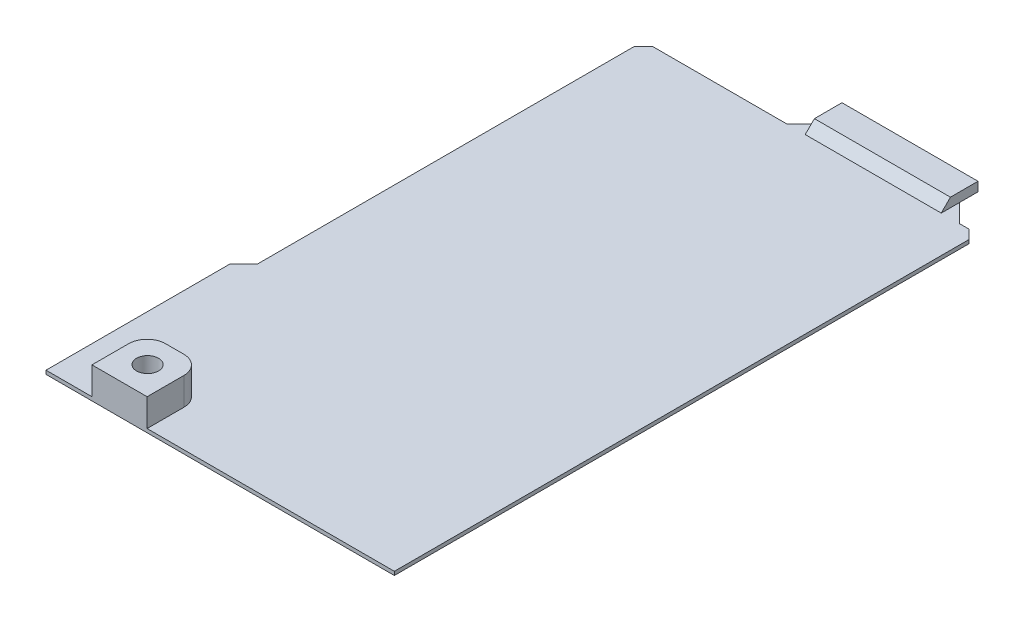
ISO-10303-21;
HEADER;
FILE_DESCRIPTION(('STEP AP214'),'2;1');
FILE_NAME('part.step','',(''),(''),'','','');
FILE_SCHEMA(('AUTOMOTIVE_DESIGN { 1 0 10303 214 1 1 1 1 }'));
ENDSEC;
DATA;
#1=APPLICATION_CONTEXT('core data for automotive mechanical design processes');
#2=APPLICATION_PROTOCOL_DEFINITION('international standard','automotive_design',2000,#1);
#3=PRODUCT_CONTEXT('',#1,'mechanical');
#4=PRODUCT('Part','Part','',(#3));
#5=PRODUCT_RELATED_PRODUCT_CATEGORY('part','',(#4));
#6=PRODUCT_DEFINITION_FORMATION('','',#4);
#7=PRODUCT_DEFINITION_CONTEXT('part definition',#1,'design');
#8=PRODUCT_DEFINITION('design','',#6,#7);
#9=PRODUCT_DEFINITION_SHAPE('','',#8);
#10=(LENGTH_UNIT() NAMED_UNIT(*) SI_UNIT(.MILLI.,.METRE.));
#11=(NAMED_UNIT(*) PLANE_ANGLE_UNIT() SI_UNIT($,.RADIAN.));
#12=(NAMED_UNIT(*) SI_UNIT($,.STERADIAN.) SOLID_ANGLE_UNIT());
#13=UNCERTAINTY_MEASURE_WITH_UNIT(LENGTH_MEASURE(1.E-05),#10,'distance_accuracy_value','');
#14=(GEOMETRIC_REPRESENTATION_CONTEXT(3) GLOBAL_UNCERTAINTY_ASSIGNED_CONTEXT((#13)) GLOBAL_UNIT_ASSIGNED_CONTEXT((#10,
#11,#12)) REPRESENTATION_CONTEXT('',''));
#15=CARTESIAN_POINT('',(0.,0.,0.));
#16=DIRECTION('',(0.,0.,1.));
#17=DIRECTION('',(1.,0.,0.));
#18=AXIS2_PLACEMENT_3D('',#15,#16,#17);
#19=CARTESIAN_POINT('',(8.,4.,-3.05));
#20=DIRECTION('',(0.,-1.,0.));
#21=DIRECTION('',(0.,0.,-1.));
#22=AXIS2_PLACEMENT_3D('',#19,#20,#21);
#23=CYLINDRICAL_SURFACE('',#22,1.2);
#24=CARTESIAN_POINT('',(8.,4.,-3.05));
#25=DIRECTION('',(0.,-1.,0.));
#26=DIRECTION('',(0.,0.,-1.));
#27=AXIS2_PLACEMENT_3D('',#24,#25,#26);
#28=CIRCLE('',#27,1.2);
#29=CARTESIAN_POINT('',(8.,4.,-4.25));
#30=VERTEX_POINT('',#29);
#31=EDGE_CURVE('E427',#30,#30,#28,.T.);
#32=ORIENTED_EDGE('',*,*,#31,.F.);
#33=EDGE_LOOP('',(#32));
#34=FACE_BOUND('',#33,.T.);
#35=CARTESIAN_POINT('',(8.,2.,-3.05));
#36=DIRECTION('',(0.,-1.,0.));
#37=DIRECTION('',(0.,0.,-1.));
#38=AXIS2_PLACEMENT_3D('',#35,#36,#37);
#39=CIRCLE('',#38,1.2);
#40=CARTESIAN_POINT('',(8.,2.,-4.25));
#41=VERTEX_POINT('',#40);
#42=EDGE_CURVE('E424',#41,#41,#39,.F.);
#43=ORIENTED_EDGE('',*,*,#42,.F.);
#44=EDGE_LOOP('',(#43));
#45=FACE_BOUND('',#44,.T.);
#46=ADVANCED_FACE('F37',(#34,#45),#23,.F.);
#47=CARTESIAN_POINT('',(0.,1.,0.));
#48=DIRECTION('',(0.,-1.,0.));
#49=DIRECTION('',(0.,0.,-1.));
#50=AXIS2_PLACEMENT_3D('',#47,#48,#49);
#51=PLANE('',#50);
#52=DIRECTION('',(0.,0.,-1.));
#53=VECTOR('',#52,1.);
#54=CARTESIAN_POINT('',(11.,1.,0.));
#55=LINE('',#54,#53);
#56=CARTESIAN_POINT('',(11.,1.,0.));
#57=VERTEX_POINT('',#56);
#58=CARTESIAN_POINT('',(11.,1.,-4.));
#59=VERTEX_POINT('',#58);
#60=EDGE_CURVE('E949',#57,#59,#55,.T.);
#61=ORIENTED_EDGE('',*,*,#60,.F.);
#62=DIRECTION('',(1.,0.,0.));
#63=VECTOR('',#62,1.);
#64=CARTESIAN_POINT('',(0.,1.,0.));
#65=LINE('',#64,#63);
#66=CARTESIAN_POINT('',(37.9,1.,0.));
#67=VERTEX_POINT('',#66);
#68=EDGE_CURVE('E248',#57,#67,#65,.T.);
#69=ORIENTED_EDGE('',*,*,#68,.T.);
#70=DIRECTION('',(0.,0.,-1.));
#71=VECTOR('',#70,1.);
#72=CARTESIAN_POINT('',(37.9,1.,0.));
#73=LINE('',#72,#71);
#74=CARTESIAN_POINT('',(37.9,1.,-62.5));
#75=VERTEX_POINT('',#74);
#76=EDGE_CURVE('E286',#67,#75,#73,.T.);
#77=ORIENTED_EDGE('',*,*,#76,.T.);
#78=DIRECTION('',(-0.707106781186547,0.,-0.707106781186547));
#79=VECTOR('',#78,1.);
#80=CARTESIAN_POINT('',(36.9,1.,-63.5));
#81=LINE('',#80,#79);
#82=CARTESIAN_POINT('',(36.9,1.,-63.5));
#83=VERTEX_POINT('',#82);
#84=EDGE_CURVE('E288',#75,#83,#81,.T.);
#85=ORIENTED_EDGE('',*,*,#84,.T.);
#86=DIRECTION('',(-1.,0.,0.));
#87=VECTOR('',#86,1.);
#88=CARTESIAN_POINT('',(35.9,1.,-63.5));
#89=LINE('',#88,#87);
#90=CARTESIAN_POINT('',(35.9,1.,-63.5));
#91=VERTEX_POINT('',#90);
#92=EDGE_CURVE('E290',#83,#91,#89,.T.);
#93=ORIENTED_EDGE('',*,*,#92,.T.);
#94=DIRECTION('',(-0.707106781186547,0.,-0.707106781186547));
#95=VECTOR('',#94,1.);
#96=CARTESIAN_POINT('',(35.9,1.,-63.5));
#97=LINE('',#96,#95);
#98=CARTESIAN_POINT('',(33.9,1.,-65.5));
#99=VERTEX_POINT('',#98);
#100=EDGE_CURVE('E292',#91,#99,#97,.T.);
#101=ORIENTED_EDGE('',*,*,#100,.T.);
#102=DIRECTION('',(0.,0.,-1.));
#103=VECTOR('',#102,1.);
#104=CARTESIAN_POINT('',(33.9,1.,-67.5));
#105=LINE('',#104,#103);
#106=CARTESIAN_POINT('',(33.9,1.,-63.5));
#107=VERTEX_POINT('',#106);
#108=EDGE_CURVE('E270',#107,#99,#105,.T.);
#109=ORIENTED_EDGE('',*,*,#108,.F.);
#110=DIRECTION('',(1.,0.,0.));
#111=VECTOR('',#110,1.);
#112=CARTESIAN_POINT('',(19.1,1.,-63.5));
#113=LINE('',#112,#111);
#114=CARTESIAN_POINT('',(19.1,1.,-63.5));
#115=VERTEX_POINT('',#114);
#116=EDGE_CURVE('E253',#115,#107,#113,.T.);
#117=ORIENTED_EDGE('',*,*,#116,.F.);
#118=DIRECTION('',(0.,0.,1.));
#119=VECTOR('',#118,1.);
#120=CARTESIAN_POINT('',(19.1,1.,-67.5));
#121=LINE('',#120,#119);
#122=CARTESIAN_POINT('',(19.1,1.,-65.5));
#123=VERTEX_POINT('',#122);
#124=EDGE_CURVE('E255',#123,#115,#121,.T.);
#125=ORIENTED_EDGE('',*,*,#124,.F.);
#126=DIRECTION('',(-0.707106781186547,0.,0.707106781186548));
#127=VECTOR('',#126,1.);
#128=CARTESIAN_POINT('',(17.1,1.,-63.5));
#129=LINE('',#128,#127);
#130=CARTESIAN_POINT('',(17.1,1.,-63.5));
#131=VERTEX_POINT('',#130);
#132=EDGE_CURVE('E297',#123,#131,#129,.T.);
#133=ORIENTED_EDGE('',*,*,#132,.T.);
#134=DIRECTION('',(-1.,0.,0.));
#135=VECTOR('',#134,1.);
#136=CARTESIAN_POINT('',(2.50000000000001,1.,-63.5));
#137=LINE('',#136,#135);
#138=CARTESIAN_POINT('',(2.50000000000001,1.,-63.5));
#139=VERTEX_POINT('',#138);
#140=EDGE_CURVE('E299',#131,#139,#137,.T.);
#141=ORIENTED_EDGE('',*,*,#140,.T.);
#142=DIRECTION('',(-0.707106781186547,0.,0.707106781186548));
#143=VECTOR('',#142,1.);
#144=CARTESIAN_POINT('',(1.50000000000001,1.,-62.5));
#145=LINE('',#144,#143);
#146=CARTESIAN_POINT('',(1.50000000000001,1.,-62.5));
#147=VERTEX_POINT('',#146);
#148=EDGE_CURVE('E301',#139,#147,#145,.T.);
#149=ORIENTED_EDGE('',*,*,#148,.T.);
#150=DIRECTION('',(0.,0.,1.));
#151=VECTOR('',#150,1.);
#152=CARTESIAN_POINT('',(1.50000000000001,1.,-62.5));
#153=LINE('',#152,#151);
#154=CARTESIAN_POINT('',(1.50000000000002,1.,-21.5));
#155=VERTEX_POINT('',#154);
#156=EDGE_CURVE('E303',#147,#155,#153,.T.);
#157=ORIENTED_EDGE('',*,*,#156,.T.);
#158=DIRECTION('',(-0.707106781186549,0.,0.707106781186546));
#159=VECTOR('',#158,1.);
#160=CARTESIAN_POINT('',(1.50000000000002,1.,-21.5));
#161=LINE('',#160,#159);
#162=CARTESIAN_POINT('',(0.,1.,-20.));
#163=VERTEX_POINT('',#162);
#164=EDGE_CURVE('E305',#155,#163,#161,.T.);
#165=ORIENTED_EDGE('',*,*,#164,.T.);
#166=DIRECTION('',(0.,0.,1.));
#167=VECTOR('',#166,1.);
#168=CARTESIAN_POINT('',(0.,1.,0.));
#169=LINE('',#168,#167);
#170=CARTESIAN_POINT('',(0.,1.,0.));
#171=VERTEX_POINT('',#170);
#172=EDGE_CURVE('E280',#163,#171,#169,.T.);
#173=ORIENTED_EDGE('',*,*,#172,.T.);
#174=CARTESIAN_POINT('',(5.,1.,0.));
#175=VERTEX_POINT('',#174);
#176=EDGE_CURVE('E284',#171,#175,#65,.T.);
#177=ORIENTED_EDGE('',*,*,#176,.T.);
#178=DIRECTION('',(0.,0.,1.));
#179=VECTOR('',#178,1.);
#180=CARTESIAN_POINT('',(5.,1.,-4.));
#181=LINE('',#180,#179);
#182=CARTESIAN_POINT('',(5.,1.,-4.));
#183=VERTEX_POINT('',#182);
#184=EDGE_CURVE('E243',#183,#175,#181,.T.);
#185=ORIENTED_EDGE('',*,*,#184,.F.);
#186=CARTESIAN_POINT('',(7.,1.,-4.));
#187=DIRECTION('',(0.,1.,0.));
#188=DIRECTION('',(0.,0.,1.));
#189=AXIS2_PLACEMENT_3D('',#186,#187,#188);
#190=CIRCLE('',#189,2.);
#191=CARTESIAN_POINT('',(7.,1.,-6.));
#192=VERTEX_POINT('',#191);
#193=EDGE_CURVE('E965',#192,#183,#190,.T.);
#194=ORIENTED_EDGE('',*,*,#193,.F.);
#195=DIRECTION('',(-1.,0.,0.));
#196=VECTOR('',#195,1.);
#197=CARTESIAN_POINT('',(9.,1.,-6.));
#198=LINE('',#197,#196);
#199=CARTESIAN_POINT('',(9.,1.,-6.));
#200=VERTEX_POINT('',#199);
#201=EDGE_CURVE('E962',#200,#192,#198,.T.);
#202=ORIENTED_EDGE('',*,*,#201,.F.);
#203=CARTESIAN_POINT('',(9.,1.,-4.));
#204=DIRECTION('',(0.,1.,0.));
#205=DIRECTION('',(0.,0.,1.));
#206=AXIS2_PLACEMENT_3D('',#203,#204,#205);
#207=CIRCLE('',#206,2.);
#208=EDGE_CURVE('E959',#59,#200,#207,.T.);
#209=ORIENTED_EDGE('',*,*,#208,.F.);
#210=EDGE_LOOP('',(#61,#69,#77,#85,#93,#101,#109,#117,#125,#133,#141,#149,#157,#165,#173,#177,
#185,#194,#202,#209));
#211=FACE_BOUND('',#210,.T.);
#212=ADVANCED_FACE('F436',(#211),#51,.F.);
#213=CARTESIAN_POINT('',(0.,1.,0.));
#214=DIRECTION('',(1.,0.,0.));
#215=DIRECTION('',(0.,0.,-1.));
#216=AXIS2_PLACEMENT_3D('',#213,#214,#215);
#217=PLANE('',#216);
#218=DIRECTION('',(0.,-1.,0.));
#219=VECTOR('',#218,1.);
#220=CARTESIAN_POINT('',(0.,1.,-20.));
#221=LINE('',#220,#219);
#222=CARTESIAN_POINT('',(0.,0.600000000000003,-20.));
#223=VERTEX_POINT('',#222);
#224=EDGE_CURVE('E307',#163,#223,#221,.T.);
#225=ORIENTED_EDGE('',*,*,#224,.T.);
#226=DIRECTION('',(0.,0.,1.));
#227=VECTOR('',#226,1.);
#228=CARTESIAN_POINT('',(0.,0.600000000000003,0.));
#229=LINE('',#228,#227);
#230=CARTESIAN_POINT('',(0.,0.600000000000003,0.));
#231=VERTEX_POINT('',#230);
#232=EDGE_CURVE('E390',#223,#231,#229,.T.);
#233=ORIENTED_EDGE('',*,*,#232,.T.);
#234=DIRECTION('',(0.,-1.,0.));
#235=VECTOR('',#234,1.);
#236=CARTESIAN_POINT('',(0.,1.,0.));
#237=LINE('',#236,#235);
#238=EDGE_CURVE('E340',#171,#231,#237,.T.);
#239=ORIENTED_EDGE('',*,*,#238,.F.);
#240=ORIENTED_EDGE('',*,*,#172,.F.);
#241=EDGE_LOOP('',(#225,#233,#239,#240));
#242=FACE_BOUND('',#241,.T.);
#243=ADVANCED_FACE('F485',(#242),#217,.F.);
#244=CARTESIAN_POINT('',(0.,1.,0.));
#245=DIRECTION('',(0.,0.,-1.));
#246=DIRECTION('',(-1.,0.,0.));
#247=AXIS2_PLACEMENT_3D('',#244,#245,#246);
#248=PLANE('',#247);
#249=ORIENTED_EDGE('',*,*,#238,.T.);
#250=DIRECTION('',(1.,0.,0.));
#251=VECTOR('',#250,1.);
#252=CARTESIAN_POINT('',(37.9,0.600000000000003,0.));
#253=LINE('',#252,#251);
#254=CARTESIAN_POINT('',(37.9,0.600000000000003,0.));
#255=VERTEX_POINT('',#254);
#256=EDGE_CURVE('E342',#231,#255,#253,.T.);
#257=ORIENTED_EDGE('',*,*,#256,.T.);
#258=DIRECTION('',(0.,-1.,0.));
#259=VECTOR('',#258,1.);
#260=CARTESIAN_POINT('',(37.9,1.,0.));
#261=LINE('',#260,#259);
#262=EDGE_CURVE('E337',#67,#255,#261,.T.);
#263=ORIENTED_EDGE('',*,*,#262,.F.);
#264=ORIENTED_EDGE('',*,*,#68,.F.);
#265=DIRECTION('',(0.,-1.,0.));
#266=VECTOR('',#265,1.);
#267=CARTESIAN_POINT('',(11.,4.,0.));
#268=LINE('',#267,#266);
#269=CARTESIAN_POINT('',(11.,4.,0.));
#270=VERTEX_POINT('',#269);
#271=EDGE_CURVE('E228',#270,#57,#268,.T.);
#272=ORIENTED_EDGE('',*,*,#271,.F.);
#273=DIRECTION('',(1.,0.,0.));
#274=VECTOR('',#273,1.);
#275=CARTESIAN_POINT('',(5.,4.,0.));
#276=LINE('',#275,#274);
#277=CARTESIAN_POINT('',(5.,4.,0.));
#278=VERTEX_POINT('',#277);
#279=EDGE_CURVE('E234',#278,#270,#276,.T.);
#280=ORIENTED_EDGE('',*,*,#279,.F.);
#281=DIRECTION('',(0.,-1.,0.));
#282=VECTOR('',#281,1.);
#283=CARTESIAN_POINT('',(5.,4.,0.));
#284=LINE('',#283,#282);
#285=EDGE_CURVE('E957',#278,#175,#284,.T.);
#286=ORIENTED_EDGE('',*,*,#285,.T.);
#287=ORIENTED_EDGE('',*,*,#176,.F.);
#288=EDGE_LOOP('',(#249,#257,#263,#264,#272,#280,#286,#287));
#289=FACE_BOUND('',#288,.T.);
#290=ADVANCED_FACE('F246',(#289),#248,.F.);
#291=CARTESIAN_POINT('',(37.9,1.,0.));
#292=DIRECTION('',(-1.,0.,0.));
#293=DIRECTION('',(0.,0.,1.));
#294=AXIS2_PLACEMENT_3D('',#291,#292,#293);
#295=PLANE('',#294);
#296=ORIENTED_EDGE('',*,*,#262,.T.);
#297=DIRECTION('',(0.,0.,-1.));
#298=VECTOR('',#297,1.);
#299=CARTESIAN_POINT('',(37.9,0.600000000000003,-62.5));
#300=LINE('',#299,#298);
#301=CARTESIAN_POINT('',(37.9,0.600000000000003,-62.5));
#302=VERTEX_POINT('',#301);
#303=EDGE_CURVE('E370',#255,#302,#300,.T.);
#304=ORIENTED_EDGE('',*,*,#303,.T.);
#305=DIRECTION('',(0.,-1.,0.));
#306=VECTOR('',#305,1.);
#307=CARTESIAN_POINT('',(37.9,1.,-62.5));
#308=LINE('',#307,#306);
#309=EDGE_CURVE('E334',#75,#302,#308,.T.);
#310=ORIENTED_EDGE('',*,*,#309,.F.);
#311=ORIENTED_EDGE('',*,*,#76,.F.);
#312=EDGE_LOOP('',(#296,#304,#310,#311));
#313=FACE_BOUND('',#312,.T.);
#314=ADVANCED_FACE('F503',(#313),#295,.F.);
#315=CARTESIAN_POINT('',(36.9,1.,-63.5));
#316=DIRECTION('',(-0.707106781186547,0.,0.707106781186547));
#317=DIRECTION('',(0.707106781186548,0.,0.707106781186548));
#318=AXIS2_PLACEMENT_3D('',#315,#316,#317);
#319=PLANE('',#318);
#320=ORIENTED_EDGE('',*,*,#309,.T.);
#321=DIRECTION('',(-0.707106781186548,0.,-0.707106781186548));
#322=VECTOR('',#321,1.);
#323=CARTESIAN_POINT('',(36.9,0.600000000000003,-63.5));
#324=LINE('',#323,#322);
#325=CARTESIAN_POINT('',(36.9,0.600000000000003,-63.5));
#326=VERTEX_POINT('',#325);
#327=EDGE_CURVE('E372',#302,#326,#324,.T.);
#328=ORIENTED_EDGE('',*,*,#327,.T.);
#329=DIRECTION('',(0.,-1.,0.));
#330=VECTOR('',#329,1.);
#331=CARTESIAN_POINT('',(36.9,1.,-63.5));
#332=LINE('',#331,#330);
#333=EDGE_CURVE('E331',#83,#326,#332,.T.);
#334=ORIENTED_EDGE('',*,*,#333,.F.);
#335=ORIENTED_EDGE('',*,*,#84,.F.);
#336=EDGE_LOOP('',(#320,#328,#334,#335));
#337=FACE_BOUND('',#336,.T.);
#338=ADVANCED_FACE('F508',(#337),#319,.F.);
#339=CARTESIAN_POINT('',(35.9,1.,-63.5));
#340=DIRECTION('',(0.,0.,1.));
#341=DIRECTION('',(1.,0.,0.));
#342=AXIS2_PLACEMENT_3D('',#339,#340,#341);
#343=PLANE('',#342);
#344=ORIENTED_EDGE('',*,*,#333,.T.);
#345=DIRECTION('',(-1.,0.,0.));
#346=VECTOR('',#345,1.);
#347=CARTESIAN_POINT('',(35.9,0.600000000000003,-63.5));
#348=LINE('',#347,#346);
#349=CARTESIAN_POINT('',(35.9,0.600000000000003,-63.5));
#350=VERTEX_POINT('',#349);
#351=EDGE_CURVE('E374',#326,#350,#348,.T.);
#352=ORIENTED_EDGE('',*,*,#351,.T.);
#353=DIRECTION('',(0.,-1.,0.));
#354=VECTOR('',#353,1.);
#355=CARTESIAN_POINT('',(35.9,1.,-63.5));
#356=LINE('',#355,#354);
#357=EDGE_CURVE('E328',#91,#350,#356,.T.);
#358=ORIENTED_EDGE('',*,*,#357,.F.);
#359=ORIENTED_EDGE('',*,*,#92,.F.);
#360=EDGE_LOOP('',(#344,#352,#358,#359));
#361=FACE_BOUND('',#360,.T.);
#362=ADVANCED_FACE('F521',(#361),#343,.F.);
#363=CARTESIAN_POINT('',(35.9,1.,-63.5));
#364=DIRECTION('',(-0.707106781186547,0.,0.707106781186547));
#365=DIRECTION('',(0.707106781186548,0.,0.707106781186548));
#366=AXIS2_PLACEMENT_3D('',#363,#364,#365);
#367=PLANE('',#366);
#368=ORIENTED_EDGE('',*,*,#357,.T.);
#369=DIRECTION('',(-0.707106781186548,0.,-0.707106781186548));
#370=VECTOR('',#369,1.);
#371=CARTESIAN_POINT('',(33.9,0.600000000000003,-65.5));
#372=LINE('',#371,#370);
#373=CARTESIAN_POINT('',(33.9,0.600000000000003,-65.5));
#374=VERTEX_POINT('',#373);
#375=EDGE_CURVE('E376',#350,#374,#372,.T.);
#376=ORIENTED_EDGE('',*,*,#375,.T.);
#377=DIRECTION('',(0.,-1.,0.));
#378=VECTOR('',#377,1.);
#379=CARTESIAN_POINT('',(33.9,1.,-65.5));
#380=LINE('',#379,#378);
#381=EDGE_CURVE('E325',#99,#374,#380,.T.);
#382=ORIENTED_EDGE('',*,*,#381,.F.);
#383=ORIENTED_EDGE('',*,*,#100,.F.);
#384=EDGE_LOOP('',(#368,#376,#382,#383));
#385=FACE_BOUND('',#384,.T.);
#386=ADVANCED_FACE('F525',(#385),#367,.F.);
#387=CARTESIAN_POINT('',(33.9,1.,-65.5));
#388=DIRECTION('',(0.,0.,1.));
#389=DIRECTION('',(1.,0.,0.));
#390=AXIS2_PLACEMENT_3D('',#387,#388,#389);
#391=PLANE('',#390);
#392=ORIENTED_EDGE('',*,*,#381,.T.);
#393=DIRECTION('',(-1.,0.,0.));
#394=VECTOR('',#393,1.);
#395=CARTESIAN_POINT('',(19.1,0.600000000000003,-65.5));
#396=LINE('',#395,#394);
#397=CARTESIAN_POINT('',(19.1,0.600000000000003,-65.5));
#398=VERTEX_POINT('',#397);
#399=EDGE_CURVE('E378',#374,#398,#396,.T.);
#400=ORIENTED_EDGE('',*,*,#399,.T.);
#401=DIRECTION('',(0.,-1.,0.));
#402=VECTOR('',#401,1.);
#403=CARTESIAN_POINT('',(19.1,1.,-65.5));
#404=LINE('',#403,#402);
#405=EDGE_CURVE('E322',#123,#398,#404,.T.);
#406=ORIENTED_EDGE('',*,*,#405,.F.);
#407=DIRECTION('',(-1.,0.,0.));
#408=VECTOR('',#407,1.);
#409=CARTESIAN_POINT('',(33.9,1.,-65.5));
#410=LINE('',#409,#408);
#411=EDGE_CURVE('E294',#99,#123,#410,.T.);
#412=ORIENTED_EDGE('',*,*,#411,.F.);
#413=EDGE_LOOP('',(#392,#400,#406,#412));
#414=FACE_BOUND('',#413,.T.);
#415=ADVANCED_FACE('F453',(#414),#391,.F.);
#416=CARTESIAN_POINT('',(17.1,1.,-63.5));
#417=DIRECTION('',(0.707106781186548,0.,0.707106781186547));
#418=DIRECTION('',(0.707106781186547,0.,-0.707106781186548));
#419=AXIS2_PLACEMENT_3D('',#416,#417,#418);
#420=PLANE('',#419);
#421=ORIENTED_EDGE('',*,*,#405,.T.);
#422=DIRECTION('',(-0.707106781186547,0.,0.707106781186548));
#423=VECTOR('',#422,1.);
#424=CARTESIAN_POINT('',(17.1,0.600000000000003,-63.5));
#425=LINE('',#424,#423);
#426=CARTESIAN_POINT('',(17.1,0.600000000000003,-63.5));
#427=VERTEX_POINT('',#426);
#428=EDGE_CURVE('E380',#398,#427,#425,.T.);
#429=ORIENTED_EDGE('',*,*,#428,.T.);
#430=DIRECTION('',(0.,-1.,0.));
#431=VECTOR('',#430,1.);
#432=CARTESIAN_POINT('',(17.1,1.,-63.5));
#433=LINE('',#432,#431);
#434=EDGE_CURVE('E319',#131,#427,#433,.T.);
#435=ORIENTED_EDGE('',*,*,#434,.F.);
#436=ORIENTED_EDGE('',*,*,#132,.F.);
#437=EDGE_LOOP('',(#421,#429,#435,#436));
#438=FACE_BOUND('',#437,.T.);
#439=ADVANCED_FACE('F459',(#438),#420,.F.);
#440=CARTESIAN_POINT('',(2.50000000000001,1.,-63.5));
#441=DIRECTION('',(0.,0.,1.));
#442=DIRECTION('',(1.,0.,0.));
#443=AXIS2_PLACEMENT_3D('',#440,#441,#442);
#444=PLANE('',#443);
#445=ORIENTED_EDGE('',*,*,#434,.T.);
#446=DIRECTION('',(-1.,0.,0.));
#447=VECTOR('',#446,1.);
#448=CARTESIAN_POINT('',(2.50000000000001,0.600000000000003,-63.5));
#449=LINE('',#448,#447);
#450=CARTESIAN_POINT('',(2.50000000000001,0.600000000000003,-63.5));
#451=VERTEX_POINT('',#450);
#452=EDGE_CURVE('E382',#427,#451,#449,.T.);
#453=ORIENTED_EDGE('',*,*,#452,.T.);
#454=DIRECTION('',(0.,-1.,0.));
#455=VECTOR('',#454,1.);
#456=CARTESIAN_POINT('',(2.50000000000001,1.,-63.5));
#457=LINE('',#456,#455);
#458=EDGE_CURVE('E316',#139,#451,#457,.T.);
#459=ORIENTED_EDGE('',*,*,#458,.F.);
#460=ORIENTED_EDGE('',*,*,#140,.F.);
#461=EDGE_LOOP('',(#445,#453,#459,#460));
#462=FACE_BOUND('',#461,.T.);
#463=ADVANCED_FACE('F465',(#462),#444,.F.);
#464=CARTESIAN_POINT('',(1.50000000000001,1.,-62.5));
#465=DIRECTION('',(0.707106781186548,0.,0.707106781186547));
#466=DIRECTION('',(0.707106781186547,0.,-0.707106781186548));
#467=AXIS2_PLACEMENT_3D('',#464,#465,#466);
#468=PLANE('',#467);
#469=ORIENTED_EDGE('',*,*,#458,.T.);
#470=DIRECTION('',(-0.707106781186547,0.,0.707106781186548));
#471=VECTOR('',#470,1.);
#472=CARTESIAN_POINT('',(1.50000000000001,0.600000000000003,-62.5));
#473=LINE('',#472,#471);
#474=CARTESIAN_POINT('',(1.50000000000001,0.600000000000003,-62.5));
#475=VERTEX_POINT('',#474);
#476=EDGE_CURVE('E384',#451,#475,#473,.T.);
#477=ORIENTED_EDGE('',*,*,#476,.T.);
#478=DIRECTION('',(0.,-1.,0.));
#479=VECTOR('',#478,1.);
#480=CARTESIAN_POINT('',(1.50000000000001,1.,-62.5));
#481=LINE('',#480,#479);
#482=EDGE_CURVE('E313',#147,#475,#481,.T.);
#483=ORIENTED_EDGE('',*,*,#482,.F.);
#484=ORIENTED_EDGE('',*,*,#148,.F.);
#485=EDGE_LOOP('',(#469,#477,#483,#484));
#486=FACE_BOUND('',#485,.T.);
#487=ADVANCED_FACE('F469',(#486),#468,.F.);
#488=CARTESIAN_POINT('',(1.50000000000001,1.,-62.5));
#489=DIRECTION('',(1.,0.,0.));
#490=DIRECTION('',(0.,0.,-1.));
#491=AXIS2_PLACEMENT_3D('',#488,#489,#490);
#492=PLANE('',#491);
#493=ORIENTED_EDGE('',*,*,#482,.T.);
#494=DIRECTION('',(0.,0.,1.));
#495=VECTOR('',#494,1.);
#496=CARTESIAN_POINT('',(1.50000000000002,0.600000000000003,-21.5));
#497=LINE('',#496,#495);
#498=CARTESIAN_POINT('',(1.50000000000002,0.600000000000003,-21.5));
#499=VERTEX_POINT('',#498);
#500=EDGE_CURVE('E386',#475,#499,#497,.T.);
#501=ORIENTED_EDGE('',*,*,#500,.T.);
#502=DIRECTION('',(0.,-1.,0.));
#503=VECTOR('',#502,1.);
#504=CARTESIAN_POINT('',(1.50000000000002,1.,-21.5));
#505=LINE('',#504,#503);
#506=EDGE_CURVE('E310',#155,#499,#505,.T.);
#507=ORIENTED_EDGE('',*,*,#506,.F.);
#508=ORIENTED_EDGE('',*,*,#156,.F.);
#509=EDGE_LOOP('',(#493,#501,#507,#508));
#510=FACE_BOUND('',#509,.T.);
#511=ADVANCED_FACE('F475',(#510),#492,.F.);
#512=CARTESIAN_POINT('',(1.50000000000002,1.,-21.5));
#513=DIRECTION('',(0.707106781186546,0.,0.707106781186549));
#514=DIRECTION('',(0.707106781186549,0.,-0.707106781186546));
#515=AXIS2_PLACEMENT_3D('',#512,#513,#514);
#516=PLANE('',#515);
#517=ORIENTED_EDGE('',*,*,#506,.T.);
#518=DIRECTION('',(-0.707106781186549,0.,0.707106781186546));
#519=VECTOR('',#518,1.);
#520=CARTESIAN_POINT('',(0.,0.600000000000003,-20.));
#521=LINE('',#520,#519);
#522=EDGE_CURVE('E388',#499,#223,#521,.T.);
#523=ORIENTED_EDGE('',*,*,#522,.T.);
#524=ORIENTED_EDGE('',*,*,#224,.F.);
#525=ORIENTED_EDGE('',*,*,#164,.F.);
#526=EDGE_LOOP('',(#517,#523,#524,#525));
#527=FACE_BOUND('',#526,.T.);
#528=ADVANCED_FACE('F481',(#527),#516,.F.);
#529=CARTESIAN_POINT('',(0.,0.,0.));
#530=DIRECTION('',(0.,-1.,0.));
#531=DIRECTION('',(0.,0.,-1.));
#532=AXIS2_PLACEMENT_3D('',#529,#530,#531);
#533=PLANE('',#532);
#534=CARTESIAN_POINT('',(8.,0.,-3.05));
#535=DIRECTION('',(0.,-1.,0.));
#536=DIRECTION('',(0.,0.,-1.));
#537=AXIS2_PLACEMENT_3D('',#534,#535,#536);
#538=CIRCLE('',#537,2.05);
#539=CARTESIAN_POINT('',(8.,0.,-5.1));
#540=VERTEX_POINT('',#539);
#541=EDGE_CURVE('E944',#540,#540,#538,.T.);
#542=ORIENTED_EDGE('',*,*,#541,.F.);
#543=EDGE_LOOP('',(#542));
#544=FACE_BOUND('',#543,.T.);
#545=DIRECTION('',(0.,0.,1.));
#546=VECTOR('',#545,1.);
#547=CARTESIAN_POINT('',(37.3,0.,0.));
#548=LINE('',#547,#546);
#549=CARTESIAN_POINT('',(37.3,0.,-62.2514718625761));
#550=VERTEX_POINT('',#549);
#551=CARTESIAN_POINT('',(37.3,0.,-0.600000000000003));
#552=VERTEX_POINT('',#551);
#553=EDGE_CURVE('E365',#550,#552,#548,.T.);
#554=ORIENTED_EDGE('',*,*,#553,.T.);
#555=DIRECTION('',(-1.,0.,0.));
#556=VECTOR('',#555,1.);
#557=CARTESIAN_POINT('',(0.,0.,-0.600000000000003));
#558=LINE('',#557,#556);
#559=CARTESIAN_POINT('',(0.600000000000003,0.,-0.600000000000003));
#560=VERTEX_POINT('',#559);
#561=EDGE_CURVE('E367',#552,#560,#558,.T.);
#562=ORIENTED_EDGE('',*,*,#561,.T.);
#563=DIRECTION('',(0.,0.,-1.));
#564=VECTOR('',#563,1.);
#565=CARTESIAN_POINT('',(0.600000000000006,0.,-20.));
#566=LINE('',#565,#564);
#567=CARTESIAN_POINT('',(0.600000000000006,0.,-19.7514718625761));
#568=VERTEX_POINT('',#567);
#569=EDGE_CURVE('E345',#560,#568,#566,.T.);
#570=ORIENTED_EDGE('',*,*,#569,.T.);
#571=DIRECTION('',(0.707106781186549,0.,-0.707106781186546));
#572=VECTOR('',#571,1.);
#573=CARTESIAN_POINT('',(1.92426406871195,0.,-21.0757359312881));
#574=LINE('',#573,#572);
#575=CARTESIAN_POINT('',(2.10000000000002,0.,-21.2514718625761));
#576=VERTEX_POINT('',#575);
#577=EDGE_CURVE('E347',#568,#576,#574,.T.);
#578=ORIENTED_EDGE('',*,*,#577,.T.);
#579=DIRECTION('',(0.,0.,-1.));
#580=VECTOR('',#579,1.);
#581=CARTESIAN_POINT('',(2.10000000000001,0.,-62.5));
#582=LINE('',#581,#580);
#583=CARTESIAN_POINT('',(2.10000000000001,0.,-62.2514718625761));
#584=VERTEX_POINT('',#583);
#585=EDGE_CURVE('E349',#576,#584,#582,.T.);
#586=ORIENTED_EDGE('',*,*,#585,.T.);
#587=DIRECTION('',(0.707106781186547,0.,-0.707106781186548));
#588=VECTOR('',#587,1.);
#589=CARTESIAN_POINT('',(2.92426406871194,0.,-63.0757359312881));
#590=LINE('',#589,#588);
#591=CARTESIAN_POINT('',(2.74852813742387,0.,-62.9));
#592=VERTEX_POINT('',#591);
#593=EDGE_CURVE('E351',#584,#592,#590,.T.);
#594=ORIENTED_EDGE('',*,*,#593,.T.);
#595=DIRECTION('',(1.,0.,0.));
#596=VECTOR('',#595,1.);
#597=CARTESIAN_POINT('',(17.1,0.,-62.9));
#598=LINE('',#597,#596);
#599=CARTESIAN_POINT('',(17.3485281374239,0.,-62.9));
#600=VERTEX_POINT('',#599);
#601=EDGE_CURVE('E353',#592,#600,#598,.T.);
#602=ORIENTED_EDGE('',*,*,#601,.T.);
#603=DIRECTION('',(0.707106781186547,0.,-0.707106781186548));
#604=VECTOR('',#603,1.);
#605=CARTESIAN_POINT('',(19.5242640687119,0.,-65.0757359312881));
#606=LINE('',#605,#604);
#607=CARTESIAN_POINT('',(19.3485281374239,0.,-64.9));
#608=VERTEX_POINT('',#607);
#609=EDGE_CURVE('E355',#600,#608,#606,.T.);
#610=ORIENTED_EDGE('',*,*,#609,.T.);
#611=DIRECTION('',(1.,0.,0.));
#612=VECTOR('',#611,1.);
#613=CARTESIAN_POINT('',(33.9,0.,-64.9));
#614=LINE('',#613,#612);
#615=CARTESIAN_POINT('',(33.6514718625761,0.,-64.9));
#616=VERTEX_POINT('',#615);
#617=EDGE_CURVE('E357',#608,#616,#614,.T.);
#618=ORIENTED_EDGE('',*,*,#617,.T.);
#619=DIRECTION('',(0.707106781186548,0.,0.707106781186548));
#620=VECTOR('',#619,1.);
#621=CARTESIAN_POINT('',(35.4757359312881,0.,-63.0757359312881));
#622=LINE('',#621,#620);
#623=CARTESIAN_POINT('',(35.6514718625761,0.,-62.9));
#624=VERTEX_POINT('',#623);
#625=EDGE_CURVE('E359',#616,#624,#622,.T.);
#626=ORIENTED_EDGE('',*,*,#625,.T.);
#627=DIRECTION('',(1.,0.,0.));
#628=VECTOR('',#627,1.);
#629=CARTESIAN_POINT('',(36.9,0.,-62.9));
#630=LINE('',#629,#628);
#631=CARTESIAN_POINT('',(36.6514718625761,0.,-62.9));
#632=VERTEX_POINT('',#631);
#633=EDGE_CURVE('E361',#624,#632,#630,.T.);
#634=ORIENTED_EDGE('',*,*,#633,.T.);
#635=DIRECTION('',(0.707106781186548,0.,0.707106781186548));
#636=VECTOR('',#635,1.);
#637=CARTESIAN_POINT('',(37.4757359312881,0.,-62.0757359312881));
#638=LINE('',#637,#636);
#639=EDGE_CURVE('E363',#632,#550,#638,.T.);
#640=ORIENTED_EDGE('',*,*,#639,.T.);
#641=EDGE_LOOP('',(#554,#562,#570,#578,#586,#594,#602,#610,#618,#626,#634,#640));
#642=FACE_BOUND('',#641,.T.);
#643=ADVANCED_FACE('F553',(#544,#642),#533,.T.);
#644=CARTESIAN_POINT('',(17.1,0.600000000000003,-63.5));
#645=DIRECTION('',(-0.499999999999999,-0.70710678118655,-0.499999999999998));
#646=DIRECTION('',(0.707106781186547,0.,-0.707106781186548));
#647=AXIS2_PLACEMENT_3D('',#644,#645,#646);
#648=PLANE('',#647);
#649=DIRECTION('',(0.281084637714826,-0.678598344545846,0.678598344545846));
#650=VECTOR('',#649,1.);
#651=CARTESIAN_POINT('',(19.3234699925426,0.060495713220376,-64.9604957132204));
#652=LINE('',#651,#650);
#653=EDGE_CURVE('E419',#608,#398,#652,.F.);
#654=ORIENTED_EDGE('',*,*,#653,.F.);
#655=ORIENTED_EDGE('',*,*,#609,.F.);
#656=DIRECTION('',(0.281084637714826,-0.678598344545846,0.678598344545846));
#657=VECTOR('',#656,1.);
#658=CARTESIAN_POINT('',(17.1,0.600000000000003,-63.5));
#659=LINE('',#658,#657);
#660=EDGE_CURVE('E283',#427,#600,#659,.T.);
#661=ORIENTED_EDGE('',*,*,#660,.F.);
#662=ORIENTED_EDGE('',*,*,#428,.F.);
#663=EDGE_LOOP('',(#654,#655,#661,#662));
#664=FACE_BOUND('',#663,.T.);
#665=ADVANCED_FACE('F536',(#664),#648,.T.);
#666=CARTESIAN_POINT('',(2.50000000000001,0.600000000000003,-63.5));
#667=DIRECTION('',(0.,-0.707106781186548,-0.707106781186548));
#668=DIRECTION('',(1.,0.,0.));
#669=AXIS2_PLACEMENT_3D('',#666,#667,#668);
#670=PLANE('',#669);
#671=ORIENTED_EDGE('',*,*,#660,.T.);
#672=ORIENTED_EDGE('',*,*,#601,.F.);
#673=DIRECTION('',(0.281084637714821,-0.678598344545847,0.678598344545847));
#674=VECTOR('',#673,1.);
#675=CARTESIAN_POINT('',(2.61173499627129,0.330247856610185,-63.2302478566102));
#676=LINE('',#675,#674);
#677=EDGE_CURVE('E416',#451,#592,#676,.T.);
#678=ORIENTED_EDGE('',*,*,#677,.F.);
#679=ORIENTED_EDGE('',*,*,#452,.F.);
#680=EDGE_LOOP('',(#671,#672,#678,#679));
#681=FACE_BOUND('',#680,.T.);
#682=ADVANCED_FACE('F540',(#681),#670,.T.);
#683=CARTESIAN_POINT('',(33.9,0.600000000000003,-65.5));
#684=DIRECTION('',(0.,-0.707106781186548,-0.707106781186548));
#685=DIRECTION('',(1.,0.,0.));
#686=AXIS2_PLACEMENT_3D('',#683,#684,#685);
#687=PLANE('',#686);
#688=ORIENTED_EDGE('',*,*,#653,.T.);
#689=ORIENTED_EDGE('',*,*,#399,.F.);
#690=DIRECTION('',(-0.28108463771483,-0.678598344545845,0.678598344545845));
#691=VECTOR('',#690,1.);
#692=CARTESIAN_POINT('',(33.9,0.600000000000003,-65.5));
#693=LINE('',#692,#691);
#694=EDGE_CURVE('E413',#616,#374,#693,.F.);
#695=ORIENTED_EDGE('',*,*,#694,.F.);
#696=ORIENTED_EDGE('',*,*,#617,.F.);
#697=EDGE_LOOP('',(#688,#689,#695,#696));
#698=FACE_BOUND('',#697,.T.);
#699=ADVANCED_FACE('F532',(#698),#687,.T.);
#700=CARTESIAN_POINT('',(1.50000000000001,0.600000000000003,-62.5));
#701=DIRECTION('',(-0.5,-0.707106781186548,-0.5));
#702=DIRECTION('',(0.707106781186547,0.,-0.707106781186548));
#703=AXIS2_PLACEMENT_3D('',#700,#701,#702);
#704=PLANE('',#703);
#705=ORIENTED_EDGE('',*,*,#677,.T.);
#706=ORIENTED_EDGE('',*,*,#593,.F.);
#707=DIRECTION('',(0.678598344545847,-0.678598344545847,0.281084637714821));
#708=VECTOR('',#707,1.);
#709=CARTESIAN_POINT('',(1.50000000000001,0.600000000000003,-62.5));
#710=LINE('',#709,#708);
#711=EDGE_CURVE('E410',#475,#584,#710,.T.);
#712=ORIENTED_EDGE('',*,*,#711,.F.);
#713=ORIENTED_EDGE('',*,*,#476,.F.);
#714=EDGE_LOOP('',(#705,#706,#712,#713));
#715=FACE_BOUND('',#714,.T.);
#716=ADVANCED_FACE('F543',(#715),#704,.T.);
#717=CARTESIAN_POINT('',(35.9,0.600000000000003,-63.5));
#718=DIRECTION('',(0.499999999999997,-0.707106781186552,-0.499999999999997));
#719=DIRECTION('',(0.707106781186548,0.,0.707106781186548));
#720=AXIS2_PLACEMENT_3D('',#717,#718,#719);
#721=PLANE('',#720);
#722=ORIENTED_EDGE('',*,*,#694,.T.);
#723=ORIENTED_EDGE('',*,*,#375,.F.);
#724=DIRECTION('',(-0.28108463771483,-0.678598344545845,0.678598344545845));
#725=VECTOR('',#724,1.);
#726=CARTESIAN_POINT('',(35.9,0.600000000000003,-63.5));
#727=LINE('',#726,#725);
#728=EDGE_CURVE('E407',#624,#350,#727,.F.);
#729=ORIENTED_EDGE('',*,*,#728,.F.);
#730=ORIENTED_EDGE('',*,*,#625,.F.);
#731=EDGE_LOOP('',(#722,#723,#729,#730));
#732=FACE_BOUND('',#731,.T.);
#733=ADVANCED_FACE('F527',(#732),#721,.T.);
#734=CARTESIAN_POINT('',(1.50000000000001,0.600000000000003,-62.5));
#735=DIRECTION('',(-0.707106781186548,-0.707106781186547,0.));
#736=DIRECTION('',(0.,0.,-1.));
#737=AXIS2_PLACEMENT_3D('',#734,#735,#736);
#738=PLANE('',#737);
#739=ORIENTED_EDGE('',*,*,#711,.T.);
#740=ORIENTED_EDGE('',*,*,#585,.F.);
#741=DIRECTION('',(0.678598344545846,-0.678598344545846,0.281084637714827));
#742=VECTOR('',#741,1.);
#743=CARTESIAN_POINT('',(-6.32048636305254,8.42048636305256,-24.7393515159303));
#744=LINE('',#743,#742);
#745=EDGE_CURVE('E404',#499,#576,#744,.T.);
#746=ORIENTED_EDGE('',*,*,#745,.F.);
#747=ORIENTED_EDGE('',*,*,#500,.F.);
#748=EDGE_LOOP('',(#739,#740,#746,#747));
#749=FACE_BOUND('',#748,.T.);
#750=ADVANCED_FACE('F548',(#749),#738,.T.);
#751=CARTESIAN_POINT('',(35.9,0.600000000000003,-63.5));
#752=DIRECTION('',(0.,-0.707106781186548,-0.707106781186548));
#753=DIRECTION('',(1.,0.,0.));
#754=AXIS2_PLACEMENT_3D('',#751,#752,#753);
#755=PLANE('',#754);
#756=ORIENTED_EDGE('',*,*,#728,.T.);
#757=ORIENTED_EDGE('',*,*,#351,.F.);
#758=DIRECTION('',(-0.281084637714823,-0.678598344545847,0.678598344545847));
#759=VECTOR('',#758,1.);
#760=CARTESIAN_POINT('',(36.8209914264407,0.409256430169457,-63.3092564301694));
#761=LINE('',#760,#759);
#762=EDGE_CURVE('E401',#632,#326,#761,.F.);
#763=ORIENTED_EDGE('',*,*,#762,.F.);
#764=ORIENTED_EDGE('',*,*,#633,.F.);
#765=EDGE_LOOP('',(#756,#757,#763,#764));
#766=FACE_BOUND('',#765,.T.);
#767=ADVANCED_FACE('F517',(#766),#755,.T.);
#768=CARTESIAN_POINT('',(1.50000000000002,0.600000000000003,-21.5));
#769=DIRECTION('',(-0.499999999999998,-0.70710678118655,-0.5));
#770=DIRECTION('',(0.707106781186549,0.,-0.707106781186546));
#771=AXIS2_PLACEMENT_3D('',#768,#769,#770);
#772=PLANE('',#771);
#773=ORIENTED_EDGE('',*,*,#745,.T.);
#774=ORIENTED_EDGE('',*,*,#577,.F.);
#775=DIRECTION('',(0.678598344545846,-0.678598344545846,0.281084637714826));
#776=VECTOR('',#775,1.);
#777=CARTESIAN_POINT('',(3.814871396611,-3.21487139661099,-18.4198285288145));
#778=LINE('',#777,#776);
#779=EDGE_CURVE('E398',#223,#568,#778,.T.);
#780=ORIENTED_EDGE('',*,*,#779,.F.);
#781=ORIENTED_EDGE('',*,*,#522,.F.);
#782=EDGE_LOOP('',(#773,#774,#780,#781));
#783=FACE_BOUND('',#782,.T.);
#784=ADVANCED_FACE('F551',(#783),#772,.T.);
#785=CARTESIAN_POINT('',(36.9,0.600000000000003,-63.5));
#786=DIRECTION('',(0.499999999999999,-0.707106781186549,-0.499999999999999));
#787=DIRECTION('',(0.707106781186548,0.,0.707106781186548));
#788=AXIS2_PLACEMENT_3D('',#785,#786,#787);
#789=PLANE('',#788);
#790=ORIENTED_EDGE('',*,*,#762,.T.);
#791=ORIENTED_EDGE('',*,*,#327,.F.);
#792=DIRECTION('',(-0.678598344545847,-0.678598344545847,0.281084637714823));
#793=VECTOR('',#792,1.);
#794=CARTESIAN_POINT('',(37.6302478566102,0.330247856610187,-62.3882650037287));
#795=LINE('',#794,#793);
#796=EDGE_CURVE('E395',#550,#302,#795,.F.);
#797=ORIENTED_EDGE('',*,*,#796,.F.);
#798=ORIENTED_EDGE('',*,*,#639,.F.);
#799=EDGE_LOOP('',(#790,#791,#797,#798));
#800=FACE_BOUND('',#799,.T.);
#801=ADVANCED_FACE('F511',(#800),#789,.T.);
#802=CARTESIAN_POINT('',(0.,0.600000000000003,0.));
#803=DIRECTION('',(-0.707106781186548,-0.707106781186548,0.));
#804=DIRECTION('',(0.,0.,-1.));
#805=AXIS2_PLACEMENT_3D('',#802,#803,#804);
#806=PLANE('',#805);
#807=ORIENTED_EDGE('',*,*,#779,.T.);
#808=ORIENTED_EDGE('',*,*,#569,.F.);
#809=DIRECTION('',(-0.577350269189626,0.577350269189626,0.577350269189626));
#810=VECTOR('',#809,1.);
#811=CARTESIAN_POINT('',(0.,0.600000000000003,0.));
#812=LINE('',#811,#810);
#813=EDGE_CURVE('E393',#231,#560,#812,.F.);
#814=ORIENTED_EDGE('',*,*,#813,.F.);
#815=ORIENTED_EDGE('',*,*,#232,.F.);
#816=EDGE_LOOP('',(#807,#808,#814,#815));
#817=FACE_BOUND('',#816,.T.);
#818=ADVANCED_FACE('F491',(#817),#806,.T.);
#819=CARTESIAN_POINT('',(37.9,0.600000000000003,0.));
#820=DIRECTION('',(0.707106781186548,-0.707106781186548,0.));
#821=DIRECTION('',(0.,0.,1.));
#822=AXIS2_PLACEMENT_3D('',#819,#820,#821);
#823=PLANE('',#822);
#824=ORIENTED_EDGE('',*,*,#796,.T.);
#825=ORIENTED_EDGE('',*,*,#303,.F.);
#826=DIRECTION('',(-0.577350269189626,-0.577350269189626,-0.577350269189626));
#827=VECTOR('',#826,1.);
#828=CARTESIAN_POINT('',(37.9,0.600000000000003,0.));
#829=LINE('',#828,#827);
#830=EDGE_CURVE('E279',#552,#255,#829,.F.);
#831=ORIENTED_EDGE('',*,*,#830,.F.);
#832=ORIENTED_EDGE('',*,*,#553,.F.);
#833=EDGE_LOOP('',(#824,#825,#831,#832));
#834=FACE_BOUND('',#833,.T.);
#835=ADVANCED_FACE('F499',(#834),#823,.T.);
#836=CARTESIAN_POINT('',(0.,0.600000000000003,0.));
#837=DIRECTION('',(0.,-0.707106781186548,0.707106781186548));
#838=DIRECTION('',(-1.,0.,0.));
#839=AXIS2_PLACEMENT_3D('',#836,#837,#838);
#840=PLANE('',#839);
#841=ORIENTED_EDGE('',*,*,#813,.T.);
#842=ORIENTED_EDGE('',*,*,#561,.F.);
#843=ORIENTED_EDGE('',*,*,#830,.T.);
#844=ORIENTED_EDGE('',*,*,#256,.F.);
#845=EDGE_LOOP('',(#841,#842,#843,#844));
#846=FACE_BOUND('',#845,.T.);
#847=ADVANCED_FACE('F494',(#846),#840,.T.);
#848=CARTESIAN_POINT('',(0.,1.,0.));
#849=DIRECTION('',(0.,1.,0.));
#850=DIRECTION('',(0.,0.,1.));
#851=AXIS2_PLACEMENT_3D('',#848,#849,#850);
#852=PLANE('',#851);
#853=CARTESIAN_POINT('',(33.9,1.,-67.5));
#854=VERTEX_POINT('',#853);
#855=EDGE_CURVE('E269',#99,#854,#105,.T.);
#856=ORIENTED_EDGE('',*,*,#855,.F.);
#857=ORIENTED_EDGE('',*,*,#411,.T.);
#858=CARTESIAN_POINT('',(19.1,1.,-67.5));
#859=VERTEX_POINT('',#858);
#860=EDGE_CURVE('E250',#859,#123,#121,.T.);
#861=ORIENTED_EDGE('',*,*,#860,.F.);
#862=DIRECTION('',(-1.,0.,0.));
#863=VECTOR('',#862,1.);
#864=CARTESIAN_POINT('',(19.1,1.,-67.5));
#865=LINE('',#864,#863);
#866=EDGE_CURVE('E263',#854,#859,#865,.T.);
#867=ORIENTED_EDGE('',*,*,#866,.F.);
#868=EDGE_LOOP('',(#856,#857,#861,#867));
#869=FACE_BOUND('',#868,.T.);
#870=ADVANCED_FACE('F449',(#869),#852,.F.);
#871=CARTESIAN_POINT('',(19.1,2.,-67.5));
#872=DIRECTION('',(1.,0.,0.));
#873=DIRECTION('',(0.,0.,-1.));
#874=AXIS2_PLACEMENT_3D('',#871,#872,#873);
#875=PLANE('',#874);
#876=ORIENTED_EDGE('',*,*,#124,.T.);
#877=DIRECTION('',(0.,0.707106781186545,-0.70710678118655));
#878=VECTOR('',#877,1.);
#879=CARTESIAN_POINT('',(19.1,2.,-64.5));
#880=LINE('',#879,#878);
#881=CARTESIAN_POINT('',(19.1,2.,-64.5));
#882=VERTEX_POINT('',#881);
#883=EDGE_CURVE('E11',#115,#882,#880,.T.);
#884=ORIENTED_EDGE('',*,*,#883,.T.);
#885=DIRECTION('',(0.,0.,1.));
#886=VECTOR('',#885,1.);
#887=CARTESIAN_POINT('',(19.1,2.,-67.5));
#888=LINE('',#887,#886);
#889=CARTESIAN_POINT('',(19.1,2.,-67.5));
#890=VERTEX_POINT('',#889);
#891=EDGE_CURVE('E260',#890,#882,#888,.T.);
#892=ORIENTED_EDGE('',*,*,#891,.F.);
#893=DIRECTION('',(0.,-1.,0.));
#894=VECTOR('',#893,1.);
#895=CARTESIAN_POINT('',(19.1,2.,-67.5));
#896=LINE('',#895,#894);
#897=EDGE_CURVE('E266',#890,#859,#896,.T.);
#898=ORIENTED_EDGE('',*,*,#897,.T.);
#899=ORIENTED_EDGE('',*,*,#860,.T.);
#900=EDGE_LOOP('',(#876,#884,#892,#898,#899));
#901=FACE_BOUND('',#900,.T.);
#902=ADVANCED_FACE('F443',(#901),#875,.F.);
#903=CARTESIAN_POINT('',(33.9,2.,-67.5));
#904=DIRECTION('',(-1.,0.,0.));
#905=DIRECTION('',(0.,0.,1.));
#906=AXIS2_PLACEMENT_3D('',#903,#904,#905);
#907=PLANE('',#906);
#908=DIRECTION('',(0.,0.,-1.));
#909=VECTOR('',#908,1.);
#910=CARTESIAN_POINT('',(33.9,2.,-67.5));
#911=LINE('',#910,#909);
#912=CARTESIAN_POINT('',(33.9,2.,-64.5));
#913=VERTEX_POINT('',#912);
#914=CARTESIAN_POINT('',(33.9,2.,-67.5));
#915=VERTEX_POINT('',#914);
#916=EDGE_CURVE('E262',#913,#915,#911,.T.);
#917=ORIENTED_EDGE('',*,*,#916,.F.);
#918=DIRECTION('',(0.,-0.707106781186545,0.70710678118655));
#919=VECTOR('',#918,1.);
#920=CARTESIAN_POINT('',(33.9,2.,-64.5));
#921=LINE('',#920,#919);
#922=EDGE_CURVE('E46',#913,#107,#921,.T.);
#923=ORIENTED_EDGE('',*,*,#922,.T.);
#924=ORIENTED_EDGE('',*,*,#108,.T.);
#925=ORIENTED_EDGE('',*,*,#855,.T.);
#926=DIRECTION('',(0.,-1.,0.));
#927=VECTOR('',#926,1.);
#928=CARTESIAN_POINT('',(33.9,2.,-67.5));
#929=LINE('',#928,#927);
#930=EDGE_CURVE('E276',#915,#854,#929,.T.);
#931=ORIENTED_EDGE('',*,*,#930,.F.);
#932=EDGE_LOOP('',(#917,#923,#924,#925,#931));
#933=FACE_BOUND('',#932,.T.);
#934=ADVANCED_FACE('F433',(#933),#907,.F.);
#935=CARTESIAN_POINT('',(19.1,2.,-67.5));
#936=DIRECTION('',(0.,0.,1.));
#937=DIRECTION('',(1.,0.,0.));
#938=AXIS2_PLACEMENT_3D('',#935,#936,#937);
#939=PLANE('',#938);
#940=ORIENTED_EDGE('',*,*,#866,.T.);
#941=ORIENTED_EDGE('',*,*,#897,.F.);
#942=DIRECTION('',(-1.,0.,0.));
#943=VECTOR('',#942,1.);
#944=CARTESIAN_POINT('',(19.1,2.,-67.5));
#945=LINE('',#944,#943);
#946=EDGE_CURVE('E265',#915,#890,#945,.T.);
#947=ORIENTED_EDGE('',*,*,#946,.F.);
#948=ORIENTED_EDGE('',*,*,#930,.T.);
#949=EDGE_LOOP('',(#940,#941,#947,#948));
#950=FACE_BOUND('',#949,.T.);
#951=ADVANCED_FACE('F600',(#950),#939,.F.);
#952=CARTESIAN_POINT('',(0.,2.,0.));
#953=DIRECTION('',(0.,1.,0.));
#954=DIRECTION('',(0.,0.,1.));
#955=AXIS2_PLACEMENT_3D('',#952,#953,#954);
#956=PLANE('',#955);
#957=ORIENTED_EDGE('',*,*,#891,.T.);
#958=DIRECTION('',(1.,0.,0.));
#959=VECTOR('',#958,1.);
#960=CARTESIAN_POINT('',(33.9,2.,-64.5));
#961=LINE('',#960,#959);
#962=EDGE_CURVE('E429',#882,#913,#961,.T.);
#963=ORIENTED_EDGE('',*,*,#962,.T.);
#964=ORIENTED_EDGE('',*,*,#916,.T.);
#965=ORIENTED_EDGE('',*,*,#946,.T.);
#966=EDGE_LOOP('',(#957,#963,#964,#965));
#967=FACE_BOUND('',#966,.T.);
#968=ADVANCED_FACE('F440',(#967),#956,.T.);
#969=CARTESIAN_POINT('',(11.,4.,0.));
#970=DIRECTION('',(-1.,0.,0.));
#971=DIRECTION('',(0.,0.,1.));
#972=AXIS2_PLACEMENT_3D('',#969,#970,#971);
#973=PLANE('',#972);
#974=ORIENTED_EDGE('',*,*,#60,.T.);
#975=DIRECTION('',(0.,-1.,0.));
#976=VECTOR('',#975,1.);
#977=CARTESIAN_POINT('',(11.,4.,-4.));
#978=LINE('',#977,#976);
#979=CARTESIAN_POINT('',(11.,4.,-4.));
#980=VERTEX_POINT('',#979);
#981=EDGE_CURVE('E230',#980,#59,#978,.T.);
#982=ORIENTED_EDGE('',*,*,#981,.F.);
#983=DIRECTION('',(0.,0.,-1.));
#984=VECTOR('',#983,1.);
#985=CARTESIAN_POINT('',(11.,4.,0.));
#986=LINE('',#985,#984);
#987=EDGE_CURVE('E223',#270,#980,#986,.T.);
#988=ORIENTED_EDGE('',*,*,#987,.F.);
#989=ORIENTED_EDGE('',*,*,#271,.T.);
#990=EDGE_LOOP('',(#974,#982,#988,#989));
#991=FACE_BOUND('',#990,.T.);
#992=ADVANCED_FACE('F226',(#991),#973,.F.);
#993=CARTESIAN_POINT('',(9.,4.,-4.));
#994=DIRECTION('',(0.,-1.,0.));
#995=DIRECTION('',(0.,0.,-1.));
#996=AXIS2_PLACEMENT_3D('',#993,#994,#995);
#997=CYLINDRICAL_SURFACE('',#996,2.);
#998=ORIENTED_EDGE('',*,*,#208,.T.);
#999=DIRECTION('',(0.,-1.,0.));
#1000=VECTOR('',#999,1.);
#1001=CARTESIAN_POINT('',(9.,4.,-6.));
#1002=LINE('',#1001,#1000);
#1003=CARTESIAN_POINT('',(9.,4.,-6.));
#1004=VERTEX_POINT('',#1003);
#1005=EDGE_CURVE('E256',#1004,#200,#1002,.T.);
#1006=ORIENTED_EDGE('',*,*,#1005,.F.);
#1007=CARTESIAN_POINT('',(9.,4.,-4.));
#1008=DIRECTION('',(0.,1.,0.));
#1009=DIRECTION('',(0.,0.,1.));
#1010=AXIS2_PLACEMENT_3D('',#1007,#1008,#1009);
#1011=CIRCLE('',#1010,2.);
#1012=EDGE_CURVE('E233',#980,#1004,#1011,.T.);
#1013=ORIENTED_EDGE('',*,*,#1012,.F.);
#1014=ORIENTED_EDGE('',*,*,#981,.T.);
#1015=EDGE_LOOP('',(#998,#1006,#1013,#1014));
#1016=FACE_BOUND('',#1015,.T.);
#1017=ADVANCED_FACE('F591',(#1016),#997,.T.);
#1018=CARTESIAN_POINT('',(9.,4.,-6.));
#1019=DIRECTION('',(0.,0.,1.));
#1020=DIRECTION('',(1.,0.,0.));
#1021=AXIS2_PLACEMENT_3D('',#1018,#1019,#1020);
#1022=PLANE('',#1021);
#1023=ORIENTED_EDGE('',*,*,#201,.T.);
#1024=DIRECTION('',(0.,-1.,0.));
#1025=VECTOR('',#1024,1.);
#1026=CARTESIAN_POINT('',(7.,4.,-6.));
#1027=LINE('',#1026,#1025);
#1028=CARTESIAN_POINT('',(7.,4.,-6.));
#1029=VERTEX_POINT('',#1028);
#1030=EDGE_CURVE('E974',#1029,#192,#1027,.T.);
#1031=ORIENTED_EDGE('',*,*,#1030,.F.);
#1032=DIRECTION('',(-1.,0.,0.));
#1033=VECTOR('',#1032,1.);
#1034=CARTESIAN_POINT('',(9.,4.,-6.));
#1035=LINE('',#1034,#1033);
#1036=EDGE_CURVE('E952',#1004,#1029,#1035,.T.);
#1037=ORIENTED_EDGE('',*,*,#1036,.F.);
#1038=ORIENTED_EDGE('',*,*,#1005,.T.);
#1039=EDGE_LOOP('',(#1023,#1031,#1037,#1038));
#1040=FACE_BOUND('',#1039,.T.);
#1041=ADVANCED_FACE('F587',(#1040),#1022,.F.);
#1042=CARTESIAN_POINT('',(7.,4.,-4.));
#1043=DIRECTION('',(0.,-1.,0.));
#1044=DIRECTION('',(0.,0.,-1.));
#1045=AXIS2_PLACEMENT_3D('',#1042,#1043,#1044);
#1046=CYLINDRICAL_SURFACE('',#1045,2.);
#1047=ORIENTED_EDGE('',*,*,#193,.T.);
#1048=DIRECTION('',(0.,-1.,0.));
#1049=VECTOR('',#1048,1.);
#1050=CARTESIAN_POINT('',(5.,4.,-4.));
#1051=LINE('',#1050,#1049);
#1052=CARTESIAN_POINT('',(5.,4.,-4.));
#1053=VERTEX_POINT('',#1052);
#1054=EDGE_CURVE('E971',#1053,#183,#1051,.T.);
#1055=ORIENTED_EDGE('',*,*,#1054,.F.);
#1056=CARTESIAN_POINT('',(7.,4.,-4.));
#1057=DIRECTION('',(0.,1.,0.));
#1058=DIRECTION('',(0.,0.,1.));
#1059=AXIS2_PLACEMENT_3D('',#1056,#1057,#1058);
#1060=CIRCLE('',#1059,2.);
#1061=EDGE_CURVE('E954',#1029,#1053,#1060,.T.);
#1062=ORIENTED_EDGE('',*,*,#1061,.F.);
#1063=ORIENTED_EDGE('',*,*,#1030,.T.);
#1064=EDGE_LOOP('',(#1047,#1055,#1062,#1063));
#1065=FACE_BOUND('',#1064,.T.);
#1066=ADVANCED_FACE('F583',(#1065),#1046,.T.);
#1067=CARTESIAN_POINT('',(5.,4.,-4.));
#1068=DIRECTION('',(1.,0.,0.));
#1069=DIRECTION('',(0.,0.,-1.));
#1070=AXIS2_PLACEMENT_3D('',#1067,#1068,#1069);
#1071=PLANE('',#1070);
#1072=ORIENTED_EDGE('',*,*,#184,.T.);
#1073=ORIENTED_EDGE('',*,*,#285,.F.);
#1074=DIRECTION('',(0.,0.,1.));
#1075=VECTOR('',#1074,1.);
#1076=CARTESIAN_POINT('',(5.,4.,-4.));
#1077=LINE('',#1076,#1075);
#1078=EDGE_CURVE('E239',#1053,#278,#1077,.T.);
#1079=ORIENTED_EDGE('',*,*,#1078,.F.);
#1080=ORIENTED_EDGE('',*,*,#1054,.T.);
#1081=EDGE_LOOP('',(#1072,#1073,#1079,#1080));
#1082=FACE_BOUND('',#1081,.T.);
#1083=ADVANCED_FACE('F579',(#1082),#1071,.F.);
#1084=CARTESIAN_POINT('',(9.,4.,-4.));
#1085=DIRECTION('',(0.,1.,0.));
#1086=DIRECTION('',(0.,0.,1.));
#1087=AXIS2_PLACEMENT_3D('',#1084,#1085,#1086);
#1088=PLANE('',#1087);
#1089=ORIENTED_EDGE('',*,*,#31,.T.);
#1090=EDGE_LOOP('',(#1089));
#1091=FACE_BOUND('',#1090,.T.);
#1092=ORIENTED_EDGE('',*,*,#279,.T.);
#1093=ORIENTED_EDGE('',*,*,#987,.T.);
#1094=ORIENTED_EDGE('',*,*,#1012,.T.);
#1095=ORIENTED_EDGE('',*,*,#1036,.T.);
#1096=ORIENTED_EDGE('',*,*,#1061,.T.);
#1097=ORIENTED_EDGE('',*,*,#1078,.T.);
#1098=EDGE_LOOP('',(#1092,#1093,#1094,#1095,#1096,#1097));
#1099=FACE_BOUND('',#1098,.T.);
#1100=ADVANCED_FACE('F237',(#1091,#1099),#1088,.T.);
#1101=CARTESIAN_POINT('',(8.,2.,-3.05));
#1102=DIRECTION('',(0.,-1.,0.));
#1103=DIRECTION('',(0.,0.,-1.));
#1104=AXIS2_PLACEMENT_3D('',#1101,#1102,#1103);
#1105=PLANE('',#1104);
#1106=CARTESIAN_POINT('',(8.,2.,-3.05));
#1107=DIRECTION('',(0.,-1.,0.));
#1108=DIRECTION('',(0.,0.,-1.));
#1109=AXIS2_PLACEMENT_3D('',#1106,#1107,#1108);
#1110=CIRCLE('',#1109,2.05);
#1111=CARTESIAN_POINT('',(8.,2.,-5.1));
#1112=VERTEX_POINT('',#1111);
#1113=EDGE_CURVE('E428',#1112,#1112,#1110,.T.);
#1114=ORIENTED_EDGE('',*,*,#1113,.T.);
#1115=EDGE_LOOP('',(#1114));
#1116=FACE_BOUND('',#1115,.T.);
#1117=ORIENTED_EDGE('',*,*,#42,.T.);
#1118=EDGE_LOOP('',(#1117));
#1119=FACE_BOUND('',#1118,.T.);
#1120=ADVANCED_FACE('F578',(#1116,#1119),#1105,.T.);
#1121=CARTESIAN_POINT('',(8.,2.,-3.05));
#1122=DIRECTION('',(0.,-1.,0.));
#1123=DIRECTION('',(0.,0.,-1.));
#1124=AXIS2_PLACEMENT_3D('',#1121,#1122,#1123);
#1125=CYLINDRICAL_SURFACE('',#1124,2.05);
#1126=ORIENTED_EDGE('',*,*,#1113,.F.);
#1127=EDGE_LOOP('',(#1126));
#1128=FACE_BOUND('',#1127,.T.);
#1129=ORIENTED_EDGE('',*,*,#541,.T.);
#1130=EDGE_LOOP('',(#1129));
#1131=FACE_BOUND('',#1130,.T.);
#1132=ADVANCED_FACE('F574',(#1128,#1131),#1125,.F.);
#1133=CARTESIAN_POINT('',(0.,2.,-64.5));
#1134=DIRECTION('',(0.,0.70710678118655,0.707106781186545));
#1135=DIRECTION('',(-1.,0.,0.));
#1136=AXIS2_PLACEMENT_3D('',#1133,#1134,#1135);
#1137=PLANE('',#1136);
#1138=ORIENTED_EDGE('',*,*,#883,.F.);
#1139=ORIENTED_EDGE('',*,*,#116,.T.);
#1140=ORIENTED_EDGE('',*,*,#922,.F.);
#1141=ORIENTED_EDGE('',*,*,#962,.F.);
#1142=EDGE_LOOP('',(#1138,#1139,#1140,#1141));
#1143=FACE_BOUND('',#1142,.T.);
#1144=ADVANCED_FACE('F40',(#1143),#1137,.T.);
#1145=CLOSED_SHELL('',(#46,#212,#243,#290,#314,#338,#362,#386,#415,#439,#463,#487,#511,#528,
#643,#665,#682,#699,#716,#733,#750,#767,#784,#801,#818,#835,#847,#870,#902,#934,#951,#968,#992,
#1017,#1041,#1066,#1083,#1100,#1120,#1132,#1144));
#1146=MANIFOLD_SOLID_BREP('B2',#1145);
#1147=ADVANCED_BREP_SHAPE_REPRESENTATION('',(#18,#1146),#14);
#1148=SHAPE_DEFINITION_REPRESENTATION(#9,#1147);
ENDSEC;
END-ISO-10303-21;
